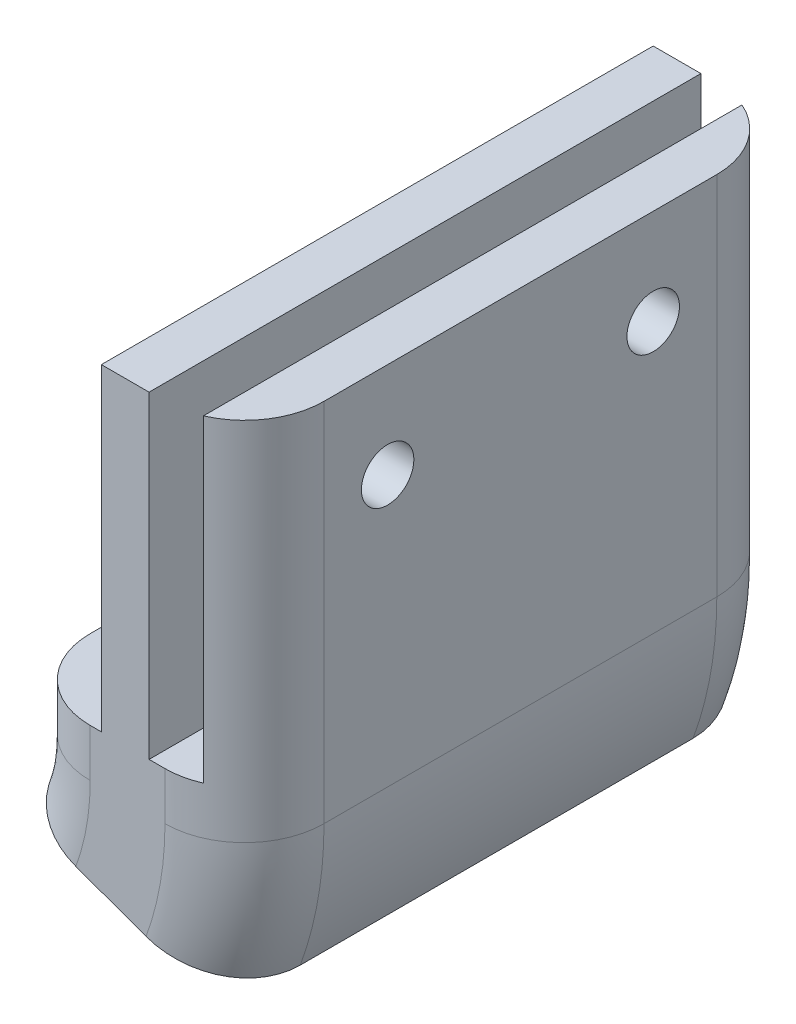
ISO-10303-21;
HEADER;
FILE_DESCRIPTION(('STEP AP214'),'2;1');
FILE_NAME('part.step','',(''),(''),'','','');
FILE_SCHEMA(('AUTOMOTIVE_DESIGN { 1 0 10303 214 1 1 1 1 }'));
ENDSEC;
DATA;
#1=APPLICATION_CONTEXT('core data for automotive mechanical design processes');
#2=APPLICATION_PROTOCOL_DEFINITION('international standard','automotive_design',2000,#1);
#3=PRODUCT_CONTEXT('',#1,'mechanical');
#4=PRODUCT('Part','Part','',(#3));
#5=PRODUCT_RELATED_PRODUCT_CATEGORY('part','',(#4));
#6=PRODUCT_DEFINITION_FORMATION('','',#4);
#7=PRODUCT_DEFINITION_CONTEXT('part definition',#1,'design');
#8=PRODUCT_DEFINITION('design','',#6,#7);
#9=PRODUCT_DEFINITION_SHAPE('','',#8);
#10=(LENGTH_UNIT() NAMED_UNIT(*) SI_UNIT(.MILLI.,.METRE.));
#11=(NAMED_UNIT(*) PLANE_ANGLE_UNIT() SI_UNIT($,.RADIAN.));
#12=(NAMED_UNIT(*) SI_UNIT($,.STERADIAN.) SOLID_ANGLE_UNIT());
#13=UNCERTAINTY_MEASURE_WITH_UNIT(LENGTH_MEASURE(1.E-05),#10,'distance_accuracy_value','');
#14=(GEOMETRIC_REPRESENTATION_CONTEXT(3) GLOBAL_UNCERTAINTY_ASSIGNED_CONTEXT((#13)) GLOBAL_UNIT_ASSIGNED_CONTEXT((#10,
#11,#12)) REPRESENTATION_CONTEXT('',''));
#15=CARTESIAN_POINT('',(0.,0.,0.));
#16=DIRECTION('',(0.,0.,1.));
#17=DIRECTION('',(1.,0.,0.));
#18=AXIS2_PLACEMENT_3D('',#15,#16,#17);
#19=CARTESIAN_POINT('',(2.35,3.,12.35));
#20=DIRECTION('',(0.,1.,0.));
#21=DIRECTION('',(0.,0.,1.));
#22=AXIS2_PLACEMENT_3D('',#19,#20,#21);
#23=PLANE('',#22);
#24=DIRECTION('',(-1.,0.,0.));
#25=VECTOR('',#24,1.);
#26=CARTESIAN_POINT('',(2.35,3.,-17.35));
#27=LINE('',#26,#25);
#28=CARTESIAN_POINT('',(2.35,3.,-17.35));
#29=VERTEX_POINT('',#28);
#30=CARTESIAN_POINT('',(1.35,3.,-17.35));
#31=VERTEX_POINT('',#30);
#32=EDGE_CURVE('E428',#29,#31,#27,.T.);
#33=ORIENTED_EDGE('',*,*,#32,.T.);
#34=DIRECTION('',(0.,0.,-1.));
#35=VECTOR('',#34,1.);
#36=CARTESIAN_POINT('',(1.35,3.,-17.35));
#37=LINE('',#36,#35);
#38=CARTESIAN_POINT('',(1.35,3.,17.35));
#39=VERTEX_POINT('',#38);
#40=EDGE_CURVE('E334',#39,#31,#37,.T.);
#41=ORIENTED_EDGE('',*,*,#40,.F.);
#42=DIRECTION('',(1.,0.,0.));
#43=VECTOR('',#42,1.);
#44=CARTESIAN_POINT('',(2.35,3.,17.35));
#45=LINE('',#44,#43);
#46=CARTESIAN_POINT('',(2.35,3.,17.35));
#47=VERTEX_POINT('',#46);
#48=EDGE_CURVE('E436',#39,#47,#45,.T.);
#49=ORIENTED_EDGE('',*,*,#48,.T.);
#50=CARTESIAN_POINT('',(2.35,3.,12.35));
#51=DIRECTION('',(0.,1.,0.));
#52=DIRECTION('',(0.,0.,1.));
#53=AXIS2_PLACEMENT_3D('',#50,#51,#52);
#54=CIRCLE('',#53,5.);
#55=CARTESIAN_POINT('',(4.35,3.,16.9325756949558));
#56=VERTEX_POINT('',#55);
#57=EDGE_CURVE('E422',#47,#56,#54,.T.);
#58=ORIENTED_EDGE('',*,*,#57,.T.);
#59=DIRECTION('',(0.,0.,1.));
#60=VECTOR('',#59,1.);
#61=CARTESIAN_POINT('',(4.35,3.,-16.9325756949558));
#62=LINE('',#61,#60);
#63=CARTESIAN_POINT('',(4.35,3.,-16.9325756949558));
#64=VERTEX_POINT('',#63);
#65=EDGE_CURVE('E361',#64,#56,#62,.T.);
#66=ORIENTED_EDGE('',*,*,#65,.F.);
#67=CARTESIAN_POINT('',(2.35,3.,-12.35));
#68=DIRECTION('',(0.,1.,0.));
#69=DIRECTION('',(0.,0.,1.));
#70=AXIS2_PLACEMENT_3D('',#67,#68,#69);
#71=CIRCLE('',#70,5.);
#72=EDGE_CURVE('E424',#64,#29,#71,.T.);
#73=ORIENTED_EDGE('',*,*,#72,.T.);
#74=EDGE_LOOP('',(#33,#41,#49,#58,#66,#73));
#75=FACE_BOUND('',#74,.T.);
#76=ADVANCED_FACE('F34',(#75),#23,.T.);
#77=CARTESIAN_POINT('',(-2.35,3.,17.35));
#78=VERTEX_POINT('',#77);
#79=CARTESIAN_POINT('',(-1.64999999999999,3.,17.35));
#80=VERTEX_POINT('',#79);
#81=EDGE_CURVE('E437',#78,#80,#45,.T.);
#82=ORIENTED_EDGE('',*,*,#81,.T.);
#83=DIRECTION('',(0.,0.,1.));
#84=VECTOR('',#83,1.);
#85=CARTESIAN_POINT('',(-1.65,3.,-17.35));
#86=LINE('',#85,#84);
#87=CARTESIAN_POINT('',(-1.65,3.,-17.35));
#88=VERTEX_POINT('',#87);
#89=EDGE_CURVE('E339',#88,#80,#86,.T.);
#90=ORIENTED_EDGE('',*,*,#89,.F.);
#91=CARTESIAN_POINT('',(-2.35,3.,-17.35));
#92=VERTEX_POINT('',#91);
#93=EDGE_CURVE('E427',#88,#92,#27,.T.);
#94=ORIENTED_EDGE('',*,*,#93,.T.);
#95=CARTESIAN_POINT('',(-2.35,3.,-12.35));
#96=DIRECTION('',(0.,1.,0.));
#97=DIRECTION('',(0.,0.,1.));
#98=AXIS2_PLACEMENT_3D('',#95,#96,#97);
#99=CIRCLE('',#98,5.);
#100=CARTESIAN_POINT('',(-7.35,3.,-12.35));
#101=VERTEX_POINT('',#100);
#102=EDGE_CURVE('E430',#92,#101,#99,.T.);
#103=ORIENTED_EDGE('',*,*,#102,.T.);
#104=DIRECTION('',(0.,0.,1.));
#105=VECTOR('',#104,1.);
#106=CARTESIAN_POINT('',(-7.35,3.,12.35));
#107=LINE('',#106,#105);
#108=CARTESIAN_POINT('',(-7.35,3.,12.35));
#109=VERTEX_POINT('',#108);
#110=EDGE_CURVE('E432',#101,#109,#107,.T.);
#111=ORIENTED_EDGE('',*,*,#110,.T.);
#112=CARTESIAN_POINT('',(-2.35,3.,12.35));
#113=DIRECTION('',(0.,1.,0.));
#114=DIRECTION('',(0.,0.,-1.));
#115=AXIS2_PLACEMENT_3D('',#112,#113,#114);
#116=CIRCLE('',#115,5.);
#117=EDGE_CURVE('E434',#109,#78,#116,.T.);
#118=ORIENTED_EDGE('',*,*,#117,.T.);
#119=EDGE_LOOP('',(#82,#90,#94,#103,#111,#118));
#120=FACE_BOUND('',#119,.T.);
#121=ADVANCED_FACE('F547',(#120),#23,.T.);
#122=CARTESIAN_POINT('',(2.35,3.,12.35));
#123=DIRECTION('',(0.,-1.,0.));
#124=DIRECTION('',(0.,0.,-1.));
#125=AXIS2_PLACEMENT_3D('',#122,#123,#124);
#126=CYLINDRICAL_SURFACE('',#125,5.);
#127=CARTESIAN_POINT('',(2.35,0.,12.35));
#128=DIRECTION('',(0.,1.,0.));
#129=DIRECTION('',(0.,0.,1.));
#130=AXIS2_PLACEMENT_3D('',#127,#128,#129);
#131=CIRCLE('',#130,5.);
#132=CARTESIAN_POINT('',(2.35,0.,17.35));
#133=VERTEX_POINT('',#132);
#134=CARTESIAN_POINT('',(7.35,0.,12.35));
#135=VERTEX_POINT('',#134);
#136=EDGE_CURVE('E421',#133,#135,#131,.T.);
#137=ORIENTED_EDGE('',*,*,#136,.T.);
#138=DIRECTION('',(0.,-1.,0.));
#139=VECTOR('',#138,1.);
#140=CARTESIAN_POINT('',(7.35,3.,12.35));
#141=LINE('',#140,#139);
#142=CARTESIAN_POINT('',(7.35,23.,12.35));
#143=VERTEX_POINT('',#142);
#144=EDGE_CURVE('E11',#143,#135,#141,.T.);
#145=ORIENTED_EDGE('',*,*,#144,.F.);
#146=CARTESIAN_POINT('',(2.35,23.,12.35));
#147=DIRECTION('',(0.,1.,0.));
#148=DIRECTION('',(0.,0.,1.));
#149=AXIS2_PLACEMENT_3D('',#146,#147,#148);
#150=CIRCLE('',#149,5.);
#151=CARTESIAN_POINT('',(4.35,23.,16.9325756949558));
#152=VERTEX_POINT('',#151);
#153=EDGE_CURVE('E362',#152,#143,#150,.T.);
#154=ORIENTED_EDGE('',*,*,#153,.F.);
#155=DIRECTION('',(0.,-1.,0.));
#156=VECTOR('',#155,1.);
#157=CARTESIAN_POINT('',(4.35,23.,16.9325756949558));
#158=LINE('',#157,#156);
#159=EDGE_CURVE('E372',#152,#56,#158,.T.);
#160=ORIENTED_EDGE('',*,*,#159,.T.);
#161=ORIENTED_EDGE('',*,*,#57,.F.);
#162=DIRECTION('',(0.,-1.,0.));
#163=VECTOR('',#162,1.);
#164=CARTESIAN_POINT('',(2.35,3.,17.35));
#165=LINE('',#164,#163);
#166=EDGE_CURVE('E439',#47,#133,#165,.T.);
#167=ORIENTED_EDGE('',*,*,#166,.T.);
#168=EDGE_LOOP('',(#137,#145,#154,#160,#161,#167));
#169=FACE_BOUND('',#168,.T.);
#170=ADVANCED_FACE('F36',(#169),#126,.T.);
#171=CARTESIAN_POINT('',(7.35,3.,12.35));
#172=DIRECTION('',(-1.,0.,0.));
#173=DIRECTION('',(0.,0.,1.));
#174=AXIS2_PLACEMENT_3D('',#171,#172,#173);
#175=PLANE('',#174);
#176=CARTESIAN_POINT('',(7.35,17.,8.35));
#177=DIRECTION('',(1.,0.,0.));
#178=DIRECTION('',(0.,0.,-1.));
#179=AXIS2_PLACEMENT_3D('',#176,#177,#178);
#180=CIRCLE('',#179,1.65);
#181=CARTESIAN_POINT('',(7.35,17.,6.7));
#182=VERTEX_POINT('',#181);
#183=EDGE_CURVE('E323',#182,#182,#180,.T.);
#184=ORIENTED_EDGE('',*,*,#183,.F.);
#185=EDGE_LOOP('',(#184));
#186=FACE_BOUND('',#185,.T.);
#187=CARTESIAN_POINT('',(7.35,17.,-8.35));
#188=DIRECTION('',(1.,0.,0.));
#189=DIRECTION('',(0.,0.,1.));
#190=AXIS2_PLACEMENT_3D('',#187,#188,#189);
#191=CIRCLE('',#190,1.65);
#192=CARTESIAN_POINT('',(7.35,17.,-6.7));
#193=VERTEX_POINT('',#192);
#194=EDGE_CURVE('E275',#193,#193,#191,.T.);
#195=ORIENTED_EDGE('',*,*,#194,.F.);
#196=EDGE_LOOP('',(#195));
#197=FACE_BOUND('',#196,.T.);
#198=DIRECTION('',(0.,0.,-1.));
#199=VECTOR('',#198,1.);
#200=CARTESIAN_POINT('',(7.35,0.,12.35));
#201=LINE('',#200,#199);
#202=CARTESIAN_POINT('',(7.35,0.,-12.35));
#203=VERTEX_POINT('',#202);
#204=EDGE_CURVE('E442',#135,#203,#201,.T.);
#205=ORIENTED_EDGE('',*,*,#204,.T.);
#206=DIRECTION('',(0.,-1.,0.));
#207=VECTOR('',#206,1.);
#208=CARTESIAN_POINT('',(7.35,3.,-12.35));
#209=LINE('',#208,#207);
#210=CARTESIAN_POINT('',(7.35,23.,-12.35));
#211=VERTEX_POINT('',#210);
#212=EDGE_CURVE('E42',#211,#203,#209,.T.);
#213=ORIENTED_EDGE('',*,*,#212,.F.);
#214=DIRECTION('',(0.,0.,-1.));
#215=VECTOR('',#214,1.);
#216=CARTESIAN_POINT('',(7.35,23.,12.35));
#217=LINE('',#216,#215);
#218=EDGE_CURVE('E365',#143,#211,#217,.T.);
#219=ORIENTED_EDGE('',*,*,#218,.F.);
#220=ORIENTED_EDGE('',*,*,#144,.T.);
#221=EDGE_LOOP('',(#205,#213,#219,#220));
#222=FACE_BOUND('',#221,.T.);
#223=ADVANCED_FACE('F480',(#186,#197,#222),#175,.F.);
#224=CARTESIAN_POINT('',(2.35,3.,-12.35));
#225=DIRECTION('',(0.,-1.,0.));
#226=DIRECTION('',(0.,0.,-1.));
#227=AXIS2_PLACEMENT_3D('',#224,#225,#226);
#228=CYLINDRICAL_SURFACE('',#227,5.);
#229=CARTESIAN_POINT('',(2.35,0.,-12.35));
#230=DIRECTION('',(0.,1.,0.));
#231=DIRECTION('',(0.,0.,1.));
#232=AXIS2_PLACEMENT_3D('',#229,#230,#231);
#233=CIRCLE('',#232,5.);
#234=CARTESIAN_POINT('',(2.35,0.,-17.35));
#235=VERTEX_POINT('',#234);
#236=EDGE_CURVE('E445',#203,#235,#233,.T.);
#237=ORIENTED_EDGE('',*,*,#236,.T.);
#238=DIRECTION('',(0.,-1.,0.));
#239=VECTOR('',#238,1.);
#240=CARTESIAN_POINT('',(2.35,3.,-17.35));
#241=LINE('',#240,#239);
#242=EDGE_CURVE('E470',#29,#235,#241,.T.);
#243=ORIENTED_EDGE('',*,*,#242,.F.);
#244=ORIENTED_EDGE('',*,*,#72,.F.);
#245=DIRECTION('',(0.,-1.,0.));
#246=VECTOR('',#245,1.);
#247=CARTESIAN_POINT('',(4.35,23.,-16.9325756949558));
#248=LINE('',#247,#246);
#249=CARTESIAN_POINT('',(4.35,23.,-16.9325756949558));
#250=VERTEX_POINT('',#249);
#251=EDGE_CURVE('E377',#250,#64,#248,.T.);
#252=ORIENTED_EDGE('',*,*,#251,.F.);
#253=CARTESIAN_POINT('',(2.35,23.,-12.35));
#254=DIRECTION('',(0.,1.,0.));
#255=DIRECTION('',(0.,0.,1.));
#256=AXIS2_PLACEMENT_3D('',#253,#254,#255);
#257=CIRCLE('',#256,5.);
#258=EDGE_CURVE('E368',#211,#250,#257,.T.);
#259=ORIENTED_EDGE('',*,*,#258,.F.);
#260=ORIENTED_EDGE('',*,*,#212,.T.);
#261=EDGE_LOOP('',(#237,#243,#244,#252,#259,#260));
#262=FACE_BOUND('',#261,.T.);
#263=ADVANCED_FACE('F475',(#262),#228,.T.);
#264=CARTESIAN_POINT('',(2.35,3.,-17.35));
#265=DIRECTION('',(0.,0.,1.));
#266=DIRECTION('',(1.,0.,0.));
#267=AXIS2_PLACEMENT_3D('',#264,#265,#266);
#268=PLANE('',#267);
#269=ORIENTED_EDGE('',*,*,#242,.T.);
#270=CARTESIAN_POINT('',(-17.35,0.,-17.35));
#271=DIRECTION('',(0.,0.,1.));
#272=DIRECTION('',(1.,0.,0.));
#273=AXIS2_PLACEMENT_3D('',#270,#271,#272);
#274=CIRCLE('',#273,19.7);
#275=CARTESIAN_POINT('',(1.16194462948239,-6.73779682351569,-17.35));
#276=VERTEX_POINT('',#275);
#277=EDGE_CURVE('E404',#276,#235,#274,.T.);
#278=ORIENTED_EDGE('',*,*,#277,.F.);
#279=DIRECTION('',(0.939692620785908,-0.342020143325669,0.));
#280=VECTOR('',#279,1.);
#281=CARTESIAN_POINT('',(1.16194462948239,-6.73779682351569,-17.35));
#282=LINE('',#281,#280);
#283=CARTESIAN_POINT('',(-3.25461068821138,-5.13030214988504,-17.35));
#284=VERTEX_POINT('',#283);
#285=EDGE_CURVE('E401',#284,#276,#282,.T.);
#286=ORIENTED_EDGE('',*,*,#285,.F.);
#287=CARTESIAN_POINT('',(-17.35,0.,-17.35));
#288=DIRECTION('',(0.,0.,1.));
#289=DIRECTION('',(1.,0.,0.));
#290=AXIS2_PLACEMENT_3D('',#287,#288,#289);
#291=CIRCLE('',#290,15.);
#292=CARTESIAN_POINT('',(-2.35,0.,-17.35));
#293=VERTEX_POINT('',#292);
#294=EDGE_CURVE('E406',#284,#293,#291,.T.);
#295=ORIENTED_EDGE('',*,*,#294,.T.);
#296=DIRECTION('',(0.,-1.,0.));
#297=VECTOR('',#296,1.);
#298=CARTESIAN_POINT('',(-2.35,3.,-17.35));
#299=LINE('',#298,#297);
#300=EDGE_CURVE('E467',#92,#293,#299,.T.);
#301=ORIENTED_EDGE('',*,*,#300,.F.);
#302=ORIENTED_EDGE('',*,*,#93,.F.);
#303=DIRECTION('',(0.,-1.,0.));
#304=VECTOR('',#303,1.);
#305=CARTESIAN_POINT('',(-1.65,23.,-17.35));
#306=LINE('',#305,#304);
#307=CARTESIAN_POINT('',(-1.65,23.,-17.35));
#308=VERTEX_POINT('',#307);
#309=EDGE_CURVE('E355',#308,#88,#306,.T.);
#310=ORIENTED_EDGE('',*,*,#309,.F.);
#311=DIRECTION('',(-1.,0.,0.));
#312=VECTOR('',#311,1.);
#313=CARTESIAN_POINT('',(1.35,23.,-17.35));
#314=LINE('',#313,#312);
#315=CARTESIAN_POINT('',(1.35,23.,-17.35));
#316=VERTEX_POINT('',#315);
#317=EDGE_CURVE('E338',#316,#308,#314,.T.);
#318=ORIENTED_EDGE('',*,*,#317,.F.);
#319=DIRECTION('',(0.,-1.,0.));
#320=VECTOR('',#319,1.);
#321=CARTESIAN_POINT('',(1.35,23.,-17.35));
#322=LINE('',#321,#320);
#323=EDGE_CURVE('E358',#316,#31,#322,.T.);
#324=ORIENTED_EDGE('',*,*,#323,.T.);
#325=ORIENTED_EDGE('',*,*,#32,.F.);
#326=EDGE_LOOP('',(#269,#278,#286,#295,#301,#302,#310,#318,#324,#325));
#327=FACE_BOUND('',#326,.T.);
#328=ADVANCED_FACE('F505',(#327),#268,.F.);
#329=CARTESIAN_POINT('',(-2.35,3.,-12.35));
#330=DIRECTION('',(0.,-1.,0.));
#331=DIRECTION('',(0.,0.,-1.));
#332=AXIS2_PLACEMENT_3D('',#329,#330,#331);
#333=CYLINDRICAL_SURFACE('',#332,5.);
#334=CARTESIAN_POINT('',(-2.35,0.,-12.35));
#335=DIRECTION('',(0.,1.,0.));
#336=DIRECTION('',(0.,0.,1.));
#337=AXIS2_PLACEMENT_3D('',#334,#335,#336);
#338=CIRCLE('',#337,5.);
#339=CARTESIAN_POINT('',(-7.35,0.,-12.35));
#340=VERTEX_POINT('',#339);
#341=EDGE_CURVE('E448',#293,#340,#338,.T.);
#342=ORIENTED_EDGE('',*,*,#341,.T.);
#343=DIRECTION('',(0.,-1.,0.));
#344=VECTOR('',#343,1.);
#345=CARTESIAN_POINT('',(-7.35,3.,-12.35));
#346=LINE('',#345,#344);
#347=EDGE_CURVE('E464',#101,#340,#346,.T.);
#348=ORIENTED_EDGE('',*,*,#347,.F.);
#349=ORIENTED_EDGE('',*,*,#102,.F.);
#350=ORIENTED_EDGE('',*,*,#300,.T.);
#351=EDGE_LOOP('',(#342,#348,#349,#350));
#352=FACE_BOUND('',#351,.T.);
#353=ADVANCED_FACE('F531',(#352),#333,.T.);
#354=CARTESIAN_POINT('',(-7.35,3.,12.35));
#355=DIRECTION('',(1.,0.,0.));
#356=DIRECTION('',(0.,0.,-1.));
#357=AXIS2_PLACEMENT_3D('',#354,#355,#356);
#358=PLANE('',#357);
#359=DIRECTION('',(0.,0.,1.));
#360=VECTOR('',#359,1.);
#361=CARTESIAN_POINT('',(-7.35,0.,12.35));
#362=LINE('',#361,#360);
#363=CARTESIAN_POINT('',(-7.35,0.,12.35));
#364=VERTEX_POINT('',#363);
#365=EDGE_CURVE('E451',#340,#364,#362,.T.);
#366=ORIENTED_EDGE('',*,*,#365,.T.);
#367=DIRECTION('',(0.,-1.,0.));
#368=VECTOR('',#367,1.);
#369=CARTESIAN_POINT('',(-7.35,3.,12.35));
#370=LINE('',#369,#368);
#371=EDGE_CURVE('E461',#109,#364,#370,.T.);
#372=ORIENTED_EDGE('',*,*,#371,.F.);
#373=ORIENTED_EDGE('',*,*,#110,.F.);
#374=ORIENTED_EDGE('',*,*,#347,.T.);
#375=EDGE_LOOP('',(#366,#372,#373,#374));
#376=FACE_BOUND('',#375,.T.);
#377=ADVANCED_FACE('F554',(#376),#358,.F.);
#378=CARTESIAN_POINT('',(-2.35,3.,12.35));
#379=DIRECTION('',(0.,-1.,0.));
#380=DIRECTION('',(0.,0.,-1.));
#381=AXIS2_PLACEMENT_3D('',#378,#379,#380);
#382=CYLINDRICAL_SURFACE('',#381,5.);
#383=CARTESIAN_POINT('',(-2.35,0.,12.35));
#384=DIRECTION('',(0.,1.,0.));
#385=DIRECTION('',(0.,0.,-1.));
#386=AXIS2_PLACEMENT_3D('',#383,#384,#385);
#387=CIRCLE('',#386,5.);
#388=CARTESIAN_POINT('',(-2.35,0.,17.35));
#389=VERTEX_POINT('',#388);
#390=EDGE_CURVE('E425',#364,#389,#387,.T.);
#391=ORIENTED_EDGE('',*,*,#390,.T.);
#392=DIRECTION('',(0.,-1.,0.));
#393=VECTOR('',#392,1.);
#394=CARTESIAN_POINT('',(-2.35,3.,17.35));
#395=LINE('',#394,#393);
#396=EDGE_CURVE('E458',#78,#389,#395,.T.);
#397=ORIENTED_EDGE('',*,*,#396,.F.);
#398=ORIENTED_EDGE('',*,*,#117,.F.);
#399=ORIENTED_EDGE('',*,*,#371,.T.);
#400=EDGE_LOOP('',(#391,#397,#398,#399));
#401=FACE_BOUND('',#400,.T.);
#402=ADVANCED_FACE('F552',(#401),#382,.T.);
#403=CARTESIAN_POINT('',(2.35,3.,17.35));
#404=DIRECTION('',(0.,0.,-1.));
#405=DIRECTION('',(-1.,0.,0.));
#406=AXIS2_PLACEMENT_3D('',#403,#404,#405);
#407=PLANE('',#406);
#408=ORIENTED_EDGE('',*,*,#396,.T.);
#409=CARTESIAN_POINT('',(-17.35,0.,17.35));
#410=DIRECTION('',(0.,0.,1.));
#411=DIRECTION('',(1.,0.,0.));
#412=AXIS2_PLACEMENT_3D('',#409,#410,#411);
#413=CIRCLE('',#412,15.);
#414=CARTESIAN_POINT('',(-3.25461068821138,-5.13030214988504,17.35));
#415=VERTEX_POINT('',#414);
#416=EDGE_CURVE('E412',#415,#389,#413,.T.);
#417=ORIENTED_EDGE('',*,*,#416,.F.);
#418=DIRECTION('',(-0.939692620785908,0.342020143325669,0.));
#419=VECTOR('',#418,1.);
#420=CARTESIAN_POINT('',(1.16194462948239,-6.73779682351569,17.35));
#421=LINE('',#420,#419);
#422=CARTESIAN_POINT('',(1.16194462948239,-6.73779682351569,17.35));
#423=VERTEX_POINT('',#422);
#424=EDGE_CURVE('E389',#423,#415,#421,.T.);
#425=ORIENTED_EDGE('',*,*,#424,.F.);
#426=CARTESIAN_POINT('',(-17.35,0.,17.35));
#427=DIRECTION('',(0.,0.,1.));
#428=DIRECTION('',(1.,0.,0.));
#429=AXIS2_PLACEMENT_3D('',#426,#427,#428);
#430=CIRCLE('',#429,19.7);
#431=EDGE_CURVE('E414',#423,#133,#430,.T.);
#432=ORIENTED_EDGE('',*,*,#431,.T.);
#433=ORIENTED_EDGE('',*,*,#166,.F.);
#434=ORIENTED_EDGE('',*,*,#48,.F.);
#435=DIRECTION('',(0.,-1.,0.));
#436=VECTOR('',#435,1.);
#437=CARTESIAN_POINT('',(1.35,23.,17.35));
#438=LINE('',#437,#436);
#439=CARTESIAN_POINT('',(1.35,23.,17.35));
#440=VERTEX_POINT('',#439);
#441=EDGE_CURVE('E345',#440,#39,#438,.T.);
#442=ORIENTED_EDGE('',*,*,#441,.F.);
#443=DIRECTION('',(1.,0.,0.));
#444=VECTOR('',#443,1.);
#445=CARTESIAN_POINT('',(1.35,23.,17.35));
#446=LINE('',#445,#444);
#447=CARTESIAN_POINT('',(-1.65,23.,17.35));
#448=VERTEX_POINT('',#447);
#449=EDGE_CURVE('E343',#448,#440,#446,.T.);
#450=ORIENTED_EDGE('',*,*,#449,.F.);
#451=DIRECTION('',(0.,-1.,0.));
#452=VECTOR('',#451,1.);
#453=CARTESIAN_POINT('',(-1.65,23.,17.35));
#454=LINE('',#453,#452);
#455=EDGE_CURVE('E352',#448,#80,#454,.T.);
#456=ORIENTED_EDGE('',*,*,#455,.T.);
#457=ORIENTED_EDGE('',*,*,#81,.F.);
#458=EDGE_LOOP('',(#408,#417,#425,#432,#433,#434,#442,#450,#456,#457));
#459=FACE_BOUND('',#458,.T.);
#460=ADVANCED_FACE('F516',(#459),#407,.F.);
#461=CARTESIAN_POINT('',(-17.35,0.,-12.35));
#462=DIRECTION('',(0.,0.,1.));
#463=DIRECTION('',(1.,0.,0.));
#464=AXIS2_PLACEMENT_3D('',#461,#462,#463);
#465=TOROIDAL_SURFACE('',#464,19.7,5.);
#466=CARTESIAN_POINT('',(-17.35,0.,-12.35));
#467=DIRECTION('',(0.,0.,1.));
#468=DIRECTION('',(1.,0.,0.));
#469=AXIS2_PLACEMENT_3D('',#466,#467,#468);
#470=CIRCLE('',#469,24.7);
#471=CARTESIAN_POINT('',(5.86040773341193,-8.44789754014403,-12.35));
#472=VERTEX_POINT('',#471);
#473=EDGE_CURVE('E418',#472,#203,#470,.T.);
#474=ORIENTED_EDGE('',*,*,#473,.F.);
#475=CARTESIAN_POINT('',(1.16194462948239,-6.73779682351569,-12.35));
#476=DIRECTION('',(-0.342020143325669,-0.939692620785908,0.));
#477=DIRECTION('',(0.,0.,-1.));
#478=AXIS2_PLACEMENT_3D('',#475,#476,#477);
#479=CIRCLE('',#478,5.);
#480=EDGE_CURVE('E380',#276,#472,#479,.T.);
#481=ORIENTED_EDGE('',*,*,#480,.F.);
#482=ORIENTED_EDGE('',*,*,#277,.T.);
#483=ORIENTED_EDGE('',*,*,#236,.F.);
#484=EDGE_LOOP('',(#474,#481,#482,#483));
#485=FACE_BOUND('',#484,.T.);
#486=ADVANCED_FACE('F499',(#485),#465,.T.);
#487=CARTESIAN_POINT('',(-17.35,0.,12.35));
#488=DIRECTION('',(0.,0.,1.));
#489=DIRECTION('',(1.,0.,0.));
#490=AXIS2_PLACEMENT_3D('',#487,#488,#489);
#491=CYLINDRICAL_SURFACE('',#490,24.7);
#492=CARTESIAN_POINT('',(-17.35,0.,12.35));
#493=DIRECTION('',(0.,0.,1.));
#494=DIRECTION('',(1.,0.,0.));
#495=AXIS2_PLACEMENT_3D('',#492,#493,#494);
#496=CIRCLE('',#495,24.7);
#497=CARTESIAN_POINT('',(5.86040773341193,-8.44789754014404,12.35));
#498=VERTEX_POINT('',#497);
#499=EDGE_CURVE('E416',#498,#135,#496,.T.);
#500=ORIENTED_EDGE('',*,*,#499,.F.);
#501=DIRECTION('',(0.,0.,1.));
#502=VECTOR('',#501,1.);
#503=CARTESIAN_POINT('',(5.86040773341193,-8.44789754014403,-12.35));
#504=LINE('',#503,#502);
#505=EDGE_CURVE('E383',#472,#498,#504,.T.);
#506=ORIENTED_EDGE('',*,*,#505,.F.);
#507=ORIENTED_EDGE('',*,*,#473,.T.);
#508=ORIENTED_EDGE('',*,*,#204,.F.);
#509=EDGE_LOOP('',(#500,#506,#507,#508));
#510=FACE_BOUND('',#509,.T.);
#511=ADVANCED_FACE('F496',(#510),#491,.T.);
#512=CARTESIAN_POINT('',(-17.35,0.,12.35));
#513=DIRECTION('',(0.,0.,1.));
#514=DIRECTION('',(1.,0.,0.));
#515=AXIS2_PLACEMENT_3D('',#512,#513,#514);
#516=TOROIDAL_SURFACE('',#515,19.7,5.);
#517=ORIENTED_EDGE('',*,*,#431,.F.);
#518=CARTESIAN_POINT('',(1.16194462948239,-6.73779682351569,12.35));
#519=DIRECTION('',(-0.342020143325669,-0.939692620785908,0.));
#520=DIRECTION('',(0.,0.,-1.));
#521=AXIS2_PLACEMENT_3D('',#518,#519,#520);
#522=CIRCLE('',#521,5.);
#523=EDGE_CURVE('E386',#498,#423,#522,.T.);
#524=ORIENTED_EDGE('',*,*,#523,.F.);
#525=ORIENTED_EDGE('',*,*,#499,.T.);
#526=ORIENTED_EDGE('',*,*,#136,.F.);
#527=EDGE_LOOP('',(#517,#524,#525,#526));
#528=FACE_BOUND('',#527,.T.);
#529=ADVANCED_FACE('F492',(#528),#516,.T.);
#530=CARTESIAN_POINT('',(-17.35,0.,12.35));
#531=DIRECTION('',(0.,0.,1.));
#532=DIRECTION('',(1.,0.,0.));
#533=AXIS2_PLACEMENT_3D('',#530,#531,#532);
#534=TOROIDAL_SURFACE('',#533,15.,5.);
#535=CARTESIAN_POINT('',(-17.35,0.,12.35));
#536=DIRECTION('',(0.,0.,1.));
#537=DIRECTION('',(1.,0.,0.));
#538=AXIS2_PLACEMENT_3D('',#535,#536,#537);
#539=CIRCLE('',#538,10.);
#540=CARTESIAN_POINT('',(-7.95307379214092,-3.42020143325669,12.35));
#541=VERTEX_POINT('',#540);
#542=EDGE_CURVE('E410',#541,#364,#539,.T.);
#543=ORIENTED_EDGE('',*,*,#542,.F.);
#544=CARTESIAN_POINT('',(-3.25461068821138,-5.13030214988504,12.35));
#545=DIRECTION('',(-0.342020143325669,-0.939692620785908,0.));
#546=DIRECTION('',(0.,0.,-1.));
#547=AXIS2_PLACEMENT_3D('',#544,#545,#546);
#548=CIRCLE('',#547,5.);
#549=EDGE_CURVE('E392',#415,#541,#548,.T.);
#550=ORIENTED_EDGE('',*,*,#549,.F.);
#551=ORIENTED_EDGE('',*,*,#416,.T.);
#552=ORIENTED_EDGE('',*,*,#390,.F.);
#553=EDGE_LOOP('',(#543,#550,#551,#552));
#554=FACE_BOUND('',#553,.T.);
#555=ADVANCED_FACE('F521',(#554),#534,.T.);
#556=CARTESIAN_POINT('',(-17.35,0.,12.35));
#557=DIRECTION('',(0.,0.,1.));
#558=DIRECTION('',(1.,0.,0.));
#559=AXIS2_PLACEMENT_3D('',#556,#557,#558);
#560=CYLINDRICAL_SURFACE('',#559,10.);
#561=CARTESIAN_POINT('',(-17.35,0.,-12.35));
#562=DIRECTION('',(0.,0.,1.));
#563=DIRECTION('',(1.,0.,0.));
#564=AXIS2_PLACEMENT_3D('',#561,#562,#563);
#565=CIRCLE('',#564,9.99999999999999);
#566=CARTESIAN_POINT('',(-7.95307379214092,-3.42020143325669,-12.35));
#567=VERTEX_POINT('',#566);
#568=EDGE_CURVE('E408',#567,#340,#565,.T.);
#569=ORIENTED_EDGE('',*,*,#568,.F.);
#570=DIRECTION('',(0.,0.,-1.));
#571=VECTOR('',#570,1.);
#572=CARTESIAN_POINT('',(-7.95307379214092,-3.42020143325669,-12.35));
#573=LINE('',#572,#571);
#574=EDGE_CURVE('E395',#541,#567,#573,.T.);
#575=ORIENTED_EDGE('',*,*,#574,.F.);
#576=ORIENTED_EDGE('',*,*,#542,.T.);
#577=ORIENTED_EDGE('',*,*,#365,.F.);
#578=EDGE_LOOP('',(#569,#575,#576,#577));
#579=FACE_BOUND('',#578,.T.);
#580=ADVANCED_FACE('F525',(#579),#560,.F.);
#581=CARTESIAN_POINT('',(-17.35,0.,-12.35));
#582=DIRECTION('',(0.,0.,1.));
#583=DIRECTION('',(1.,0.,0.));
#584=AXIS2_PLACEMENT_3D('',#581,#582,#583);
#585=TOROIDAL_SURFACE('',#584,15.,5.);
#586=ORIENTED_EDGE('',*,*,#294,.F.);
#587=CARTESIAN_POINT('',(-3.25461068821138,-5.13030214988504,-12.35));
#588=DIRECTION('',(-0.342020143325669,-0.939692620785908,0.));
#589=DIRECTION('',(0.,0.,1.));
#590=AXIS2_PLACEMENT_3D('',#587,#588,#589);
#591=CIRCLE('',#590,5.);
#592=EDGE_CURVE('E398',#567,#284,#591,.T.);
#593=ORIENTED_EDGE('',*,*,#592,.F.);
#594=ORIENTED_EDGE('',*,*,#568,.T.);
#595=ORIENTED_EDGE('',*,*,#341,.F.);
#596=EDGE_LOOP('',(#586,#593,#594,#595));
#597=FACE_BOUND('',#596,.T.);
#598=ADVANCED_FACE('F527',(#597),#585,.T.);
#599=CARTESIAN_POINT('',(1.16194462948239,-6.73779682351569,-12.35));
#600=DIRECTION('',(-0.342020143325669,-0.939692620785908,0.));
#601=DIRECTION('',(0.,0.,-1.));
#602=AXIS2_PLACEMENT_3D('',#599,#600,#601);
#603=PLANE('',#602);
#604=ORIENTED_EDGE('',*,*,#480,.T.);
#605=ORIENTED_EDGE('',*,*,#505,.T.);
#606=ORIENTED_EDGE('',*,*,#523,.T.);
#607=ORIENTED_EDGE('',*,*,#424,.T.);
#608=ORIENTED_EDGE('',*,*,#549,.T.);
#609=ORIENTED_EDGE('',*,*,#574,.T.);
#610=ORIENTED_EDGE('',*,*,#592,.T.);
#611=ORIENTED_EDGE('',*,*,#285,.T.);
#612=EDGE_LOOP('',(#604,#605,#606,#607,#608,#609,#610,#611));
#613=FACE_BOUND('',#612,.T.);
#614=ADVANCED_FACE('F501',(#613),#603,.T.);
#615=CARTESIAN_POINT('',(4.35,23.,-16.9325756949558));
#616=DIRECTION('',(1.,0.,0.));
#617=DIRECTION('',(0.,0.,-1.));
#618=AXIS2_PLACEMENT_3D('',#615,#616,#617);
#619=PLANE('',#618);
#620=CARTESIAN_POINT('',(4.35,17.,8.35));
#621=DIRECTION('',(1.,0.,0.));
#622=DIRECTION('',(0.,0.,-1.));
#623=AXIS2_PLACEMENT_3D('',#620,#621,#622);
#624=CIRCLE('',#623,1.65);
#625=CARTESIAN_POINT('',(4.35,17.,6.7));
#626=VERTEX_POINT('',#625);
#627=EDGE_CURVE('E331',#626,#626,#624,.T.);
#628=ORIENTED_EDGE('',*,*,#627,.T.);
#629=EDGE_LOOP('',(#628));
#630=FACE_BOUND('',#629,.T.);
#631=CARTESIAN_POINT('',(4.35,17.,-8.35));
#632=DIRECTION('',(1.,0.,0.));
#633=DIRECTION('',(0.,0.,-1.));
#634=AXIS2_PLACEMENT_3D('',#631,#632,#633);
#635=CIRCLE('',#634,1.65);
#636=CARTESIAN_POINT('',(4.35,17.,-10.));
#637=VERTEX_POINT('',#636);
#638=EDGE_CURVE('E326',#637,#637,#635,.T.);
#639=ORIENTED_EDGE('',*,*,#638,.T.);
#640=EDGE_LOOP('',(#639));
#641=FACE_BOUND('',#640,.T.);
#642=ORIENTED_EDGE('',*,*,#65,.T.);
#643=ORIENTED_EDGE('',*,*,#159,.F.);
#644=DIRECTION('',(0.,0.,1.));
#645=VECTOR('',#644,1.);
#646=CARTESIAN_POINT('',(4.35,23.,-16.9325756949558));
#647=LINE('',#646,#645);
#648=EDGE_CURVE('E370',#250,#152,#647,.T.);
#649=ORIENTED_EDGE('',*,*,#648,.F.);
#650=ORIENTED_EDGE('',*,*,#251,.T.);
#651=EDGE_LOOP('',(#642,#643,#649,#650));
#652=FACE_BOUND('',#651,.T.);
#653=ADVANCED_FACE('F512',(#630,#641,#652),#619,.F.);
#654=CARTESIAN_POINT('',(2.35,23.,12.35));
#655=DIRECTION('',(0.,1.,0.));
#656=DIRECTION('',(0.,0.,1.));
#657=AXIS2_PLACEMENT_3D('',#654,#655,#656);
#658=PLANE('',#657);
#659=ORIENTED_EDGE('',*,*,#153,.T.);
#660=ORIENTED_EDGE('',*,*,#218,.T.);
#661=ORIENTED_EDGE('',*,*,#258,.T.);
#662=ORIENTED_EDGE('',*,*,#648,.T.);
#663=EDGE_LOOP('',(#659,#660,#661,#662));
#664=FACE_BOUND('',#663,.T.);
#665=ADVANCED_FACE('F483',(#664),#658,.T.);
#666=CARTESIAN_POINT('',(1.35,23.,-17.35));
#667=DIRECTION('',(-1.,0.,0.));
#668=DIRECTION('',(0.,0.,1.));
#669=AXIS2_PLACEMENT_3D('',#666,#667,#668);
#670=PLANE('',#669);
#671=DIRECTION('',(0.,-0.86602540378444,0.499999999999997));
#672=VECTOR('',#671,1.);
#673=CARTESIAN_POINT('',(1.35,17.,-5.05910346561912));
#674=LINE('',#673,#672);
#675=CARTESIAN_POINT('',(1.35,19.85,-6.70455173280954));
#676=VERTEX_POINT('',#675);
#677=CARTESIAN_POINT('',(1.35,17.,-5.05910346561912));
#678=VERTEX_POINT('',#677);
#679=EDGE_CURVE('E248',#676,#678,#674,.T.);
#680=ORIENTED_EDGE('',*,*,#679,.F.);
#681=DIRECTION('',(0.,0.,1.));
#682=VECTOR('',#681,1.);
#683=CARTESIAN_POINT('',(1.35,19.85,-6.70455173280954));
#684=LINE('',#683,#682);
#685=CARTESIAN_POINT('',(1.35,19.85,-9.99544826719042));
#686=VERTEX_POINT('',#685);
#687=EDGE_CURVE('E49',#686,#676,#684,.T.);
#688=ORIENTED_EDGE('',*,*,#687,.F.);
#689=DIRECTION('',(0.,0.866025403784434,0.500000000000009));
#690=VECTOR('',#689,1.);
#691=CARTESIAN_POINT('',(1.35,19.85,-9.99544826719042));
#692=LINE('',#691,#690);
#693=CARTESIAN_POINT('',(1.35,17.,-11.6408965343809));
#694=VERTEX_POINT('',#693);
#695=EDGE_CURVE('E322',#694,#686,#692,.T.);
#696=ORIENTED_EDGE('',*,*,#695,.F.);
#697=DIRECTION('',(0.,0.866025403784439,-0.499999999999999));
#698=VECTOR('',#697,1.);
#699=CARTESIAN_POINT('',(1.35,17.,-11.6408965343809));
#700=LINE('',#699,#698);
#701=CARTESIAN_POINT('',(1.35,14.15,-9.99544826719045));
#702=VERTEX_POINT('',#701);
#703=EDGE_CURVE('E906',#702,#694,#700,.T.);
#704=ORIENTED_EDGE('',*,*,#703,.F.);
#705=DIRECTION('',(0.,0.,-1.));
#706=VECTOR('',#705,1.);
#707=CARTESIAN_POINT('',(1.35,14.15,-9.99544826719045));
#708=LINE('',#707,#706);
#709=CARTESIAN_POINT('',(1.35,14.15,-6.70455173280958));
#710=VERTEX_POINT('',#709);
#711=EDGE_CURVE('E899',#710,#702,#708,.T.);
#712=ORIENTED_EDGE('',*,*,#711,.F.);
#713=DIRECTION('',(0.,-0.866025403784434,-0.500000000000009));
#714=VECTOR('',#713,1.);
#715=CARTESIAN_POINT('',(1.35,14.15,-6.70455173280958));
#716=LINE('',#715,#714);
#717=EDGE_CURVE('E897',#678,#710,#716,.T.);
#718=ORIENTED_EDGE('',*,*,#717,.F.);
#719=EDGE_LOOP('',(#680,#688,#696,#704,#712,#718));
#720=FACE_BOUND('',#719,.T.);
#721=DIRECTION('',(0.,-0.86602540378444,0.499999999999998));
#722=VECTOR('',#721,1.);
#723=CARTESIAN_POINT('',(1.35,17.,11.6408965343809));
#724=LINE('',#723,#722);
#725=CARTESIAN_POINT('',(1.35,19.85,9.99544826719045));
#726=VERTEX_POINT('',#725);
#727=CARTESIAN_POINT('',(1.35,17.,11.6408965343809));
#728=VERTEX_POINT('',#727);
#729=EDGE_CURVE('E288',#726,#728,#724,.T.);
#730=ORIENTED_EDGE('',*,*,#729,.F.);
#731=DIRECTION('',(0.,0.,1.));
#732=VECTOR('',#731,1.);
#733=CARTESIAN_POINT('',(1.35,19.85,9.99544826719045));
#734=LINE('',#733,#732);
#735=CARTESIAN_POINT('',(1.35,19.85,6.70455173280958));
#736=VERTEX_POINT('',#735);
#737=EDGE_CURVE('E57',#736,#726,#734,.T.);
#738=ORIENTED_EDGE('',*,*,#737,.F.);
#739=DIRECTION('',(0.,0.866025403784434,0.500000000000008));
#740=VECTOR('',#739,1.);
#741=CARTESIAN_POINT('',(1.35,19.85,6.70455173280958));
#742=LINE('',#741,#740);
#743=CARTESIAN_POINT('',(1.35,17.,5.05910346561912));
#744=VERTEX_POINT('',#743);
#745=EDGE_CURVE('E276',#744,#736,#742,.T.);
#746=ORIENTED_EDGE('',*,*,#745,.F.);
#747=DIRECTION('',(0.,0.86602540378444,-0.499999999999998));
#748=VECTOR('',#747,1.);
#749=CARTESIAN_POINT('',(1.35,17.,5.05910346561912));
#750=LINE('',#749,#748);
#751=CARTESIAN_POINT('',(1.35,14.15,6.70455173280954));
#752=VERTEX_POINT('',#751);
#753=EDGE_CURVE('E279',#752,#744,#750,.T.);
#754=ORIENTED_EDGE('',*,*,#753,.F.);
#755=DIRECTION('',(0.,0.,-1.));
#756=VECTOR('',#755,1.);
#757=CARTESIAN_POINT('',(1.35,14.15,6.70455173280954));
#758=LINE('',#757,#756);
#759=CARTESIAN_POINT('',(1.35,14.15,9.99544826719042));
#760=VERTEX_POINT('',#759);
#761=EDGE_CURVE('E282',#760,#752,#758,.T.);
#762=ORIENTED_EDGE('',*,*,#761,.F.);
#763=DIRECTION('',(0.,-0.866025403784434,-0.500000000000009));
#764=VECTOR('',#763,1.);
#765=CARTESIAN_POINT('',(1.35,14.15,9.99544826719042));
#766=LINE('',#765,#764);
#767=EDGE_CURVE('E285',#728,#760,#766,.T.);
#768=ORIENTED_EDGE('',*,*,#767,.F.);
#769=EDGE_LOOP('',(#730,#738,#746,#754,#762,#768));
#770=FACE_BOUND('',#769,.T.);
#771=ORIENTED_EDGE('',*,*,#40,.T.);
#772=ORIENTED_EDGE('',*,*,#323,.F.);
#773=DIRECTION('',(0.,0.,-1.));
#774=VECTOR('',#773,1.);
#775=CARTESIAN_POINT('',(1.35,23.,-17.35));
#776=LINE('',#775,#774);
#777=EDGE_CURVE('E335',#440,#316,#776,.T.);
#778=ORIENTED_EDGE('',*,*,#777,.F.);
#779=ORIENTED_EDGE('',*,*,#441,.T.);
#780=EDGE_LOOP('',(#771,#772,#778,#779));
#781=FACE_BOUND('',#780,.T.);
#782=ADVANCED_FACE('F544',(#720,#770,#781),#670,.F.);
#783=CARTESIAN_POINT('',(-1.65,23.,-17.35));
#784=DIRECTION('',(1.,0.,0.));
#785=DIRECTION('',(0.,0.,-1.));
#786=AXIS2_PLACEMENT_3D('',#783,#784,#785);
#787=PLANE('',#786);
#788=DIRECTION('',(0.,-0.866025403784433,-0.500000000000009));
#789=VECTOR('',#788,1.);
#790=CARTESIAN_POINT('',(-1.65,19.85,-9.99544826719042));
#791=LINE('',#790,#789);
#792=CARTESIAN_POINT('',(-1.65,19.85,-9.99544826719042));
#793=VERTEX_POINT('',#792);
#794=CARTESIAN_POINT('',(-1.65,17.,-11.6408965343809));
#795=VERTEX_POINT('',#794);
#796=EDGE_CURVE('E254',#793,#795,#791,.T.);
#797=ORIENTED_EDGE('',*,*,#796,.F.);
#798=DIRECTION('',(0.,0.,-1.));
#799=VECTOR('',#798,1.);
#800=CARTESIAN_POINT('',(-1.65,19.85,-6.70455173280954));
#801=LINE('',#800,#799);
#802=CARTESIAN_POINT('',(-1.65,19.85,-6.70455173280954));
#803=VERTEX_POINT('',#802);
#804=EDGE_CURVE('E233',#803,#793,#801,.T.);
#805=ORIENTED_EDGE('',*,*,#804,.F.);
#806=DIRECTION('',(0.,0.86602540378444,-0.499999999999997));
#807=VECTOR('',#806,1.);
#808=CARTESIAN_POINT('',(-1.65,17.,-5.05910346561912));
#809=LINE('',#808,#807);
#810=CARTESIAN_POINT('',(-1.65,17.,-5.05910346561911));
#811=VERTEX_POINT('',#810);
#812=EDGE_CURVE('E243',#811,#803,#809,.T.);
#813=ORIENTED_EDGE('',*,*,#812,.F.);
#814=DIRECTION('',(0.,0.866025403784433,0.500000000000009));
#815=VECTOR('',#814,1.);
#816=CARTESIAN_POINT('',(-1.65,14.15,-6.70455173280958));
#817=LINE('',#816,#815);
#818=CARTESIAN_POINT('',(-1.65,14.15,-6.70455173280958));
#819=VERTEX_POINT('',#818);
#820=EDGE_CURVE('E239',#819,#811,#817,.T.);
#821=ORIENTED_EDGE('',*,*,#820,.F.);
#822=DIRECTION('',(0.,0.,1.));
#823=VECTOR('',#822,1.);
#824=CARTESIAN_POINT('',(-1.65,14.15,-9.99544826719045));
#825=LINE('',#824,#823);
#826=CARTESIAN_POINT('',(-1.65,14.15,-9.99544826719045));
#827=VERTEX_POINT('',#826);
#828=EDGE_CURVE('E262',#827,#819,#825,.T.);
#829=ORIENTED_EDGE('',*,*,#828,.F.);
#830=DIRECTION('',(0.,-0.866025403784439,0.499999999999999));
#831=VECTOR('',#830,1.);
#832=CARTESIAN_POINT('',(-1.65,17.,-11.6408965343809));
#833=LINE('',#832,#831);
#834=EDGE_CURVE('E256',#795,#827,#833,.T.);
#835=ORIENTED_EDGE('',*,*,#834,.F.);
#836=EDGE_LOOP('',(#797,#805,#813,#821,#829,#835));
#837=FACE_BOUND('',#836,.T.);
#838=DIRECTION('',(0.,-0.866025403784434,-0.500000000000008));
#839=VECTOR('',#838,1.);
#840=CARTESIAN_POINT('',(-1.65,19.85,6.70455173280958));
#841=LINE('',#840,#839);
#842=CARTESIAN_POINT('',(-1.65,19.85,6.70455173280958));
#843=VERTEX_POINT('',#842);
#844=CARTESIAN_POINT('',(-1.65,17.,5.05910346561912));
#845=VERTEX_POINT('',#844);
#846=EDGE_CURVE('E297',#843,#845,#841,.T.);
#847=ORIENTED_EDGE('',*,*,#846,.F.);
#848=DIRECTION('',(0.,0.,-1.));
#849=VECTOR('',#848,1.);
#850=CARTESIAN_POINT('',(-1.65,19.85,9.99544826719045));
#851=LINE('',#850,#849);
#852=CARTESIAN_POINT('',(-1.65,19.85,9.99544826719045));
#853=VERTEX_POINT('',#852);
#854=EDGE_CURVE('E294',#853,#843,#851,.T.);
#855=ORIENTED_EDGE('',*,*,#854,.F.);
#856=DIRECTION('',(0.,0.86602540378444,-0.499999999999998));
#857=VECTOR('',#856,1.);
#858=CARTESIAN_POINT('',(-1.65,17.,11.6408965343809));
#859=LINE('',#858,#857);
#860=CARTESIAN_POINT('',(-1.65,17.,11.6408965343809));
#861=VERTEX_POINT('',#860);
#862=EDGE_CURVE('E291',#861,#853,#859,.T.);
#863=ORIENTED_EDGE('',*,*,#862,.F.);
#864=DIRECTION('',(0.,0.866025403784433,0.500000000000009));
#865=VECTOR('',#864,1.);
#866=CARTESIAN_POINT('',(-1.65,14.15,9.99544826719042));
#867=LINE('',#866,#865);
#868=CARTESIAN_POINT('',(-1.65,14.15,9.99544826719042));
#869=VERTEX_POINT('',#868);
#870=EDGE_CURVE('E306',#869,#861,#867,.T.);
#871=ORIENTED_EDGE('',*,*,#870,.F.);
#872=DIRECTION('',(0.,0.,1.));
#873=VECTOR('',#872,1.);
#874=CARTESIAN_POINT('',(-1.65,14.15,6.70455173280954));
#875=LINE('',#874,#873);
#876=CARTESIAN_POINT('',(-1.65,14.15,6.70455173280954));
#877=VERTEX_POINT('',#876);
#878=EDGE_CURVE('E303',#877,#869,#875,.T.);
#879=ORIENTED_EDGE('',*,*,#878,.F.);
#880=DIRECTION('',(0.,-0.86602540378444,0.499999999999998));
#881=VECTOR('',#880,1.);
#882=CARTESIAN_POINT('',(-1.65,17.,5.05910346561912));
#883=LINE('',#882,#881);
#884=EDGE_CURVE('E300',#845,#877,#883,.T.);
#885=ORIENTED_EDGE('',*,*,#884,.F.);
#886=EDGE_LOOP('',(#847,#855,#863,#871,#879,#885));
#887=FACE_BOUND('',#886,.T.);
#888=ORIENTED_EDGE('',*,*,#89,.T.);
#889=ORIENTED_EDGE('',*,*,#455,.F.);
#890=DIRECTION('',(0.,0.,1.));
#891=VECTOR('',#890,1.);
#892=CARTESIAN_POINT('',(-1.65,23.,-17.35));
#893=LINE('',#892,#891);
#894=EDGE_CURVE('E341',#308,#448,#893,.T.);
#895=ORIENTED_EDGE('',*,*,#894,.F.);
#896=ORIENTED_EDGE('',*,*,#309,.T.);
#897=EDGE_LOOP('',(#888,#889,#895,#896));
#898=FACE_BOUND('',#897,.T.);
#899=ADVANCED_FACE('F250',(#837,#887,#898),#787,.F.);
#900=CARTESIAN_POINT('',(0.,23.,0.));
#901=DIRECTION('',(0.,-1.,0.));
#902=DIRECTION('',(0.,0.,-1.));
#903=AXIS2_PLACEMENT_3D('',#900,#901,#902);
#904=PLANE('',#903);
#905=ORIENTED_EDGE('',*,*,#777,.T.);
#906=ORIENTED_EDGE('',*,*,#317,.T.);
#907=ORIENTED_EDGE('',*,*,#894,.T.);
#908=ORIENTED_EDGE('',*,*,#449,.T.);
#909=EDGE_LOOP('',(#905,#906,#907,#908));
#910=FACE_BOUND('',#909,.T.);
#911=ADVANCED_FACE('F540',(#910),#904,.F.);
#912=CARTESIAN_POINT('',(-7.95307379214092,17.,-8.35));
#913=DIRECTION('',(1.,0.,0.));
#914=DIRECTION('',(0.,0.,-1.));
#915=AXIS2_PLACEMENT_3D('',#912,#913,#914);
#916=CYLINDRICAL_SURFACE('',#915,1.65);
#917=ORIENTED_EDGE('',*,*,#194,.T.);
#918=EDGE_LOOP('',(#917));
#919=FACE_BOUND('',#918,.T.);
#920=ORIENTED_EDGE('',*,*,#638,.F.);
#921=EDGE_LOOP('',(#920));
#922=FACE_BOUND('',#921,.T.);
#923=ADVANCED_FACE('F644',(#919,#922),#916,.F.);
#924=CARTESIAN_POINT('',(-7.95307379214092,17.,8.35));
#925=DIRECTION('',(1.,0.,0.));
#926=DIRECTION('',(0.,0.,-1.));
#927=AXIS2_PLACEMENT_3D('',#924,#925,#926);
#928=CYLINDRICAL_SURFACE('',#927,1.65);
#929=ORIENTED_EDGE('',*,*,#183,.T.);
#930=EDGE_LOOP('',(#929));
#931=FACE_BOUND('',#930,.T.);
#932=ORIENTED_EDGE('',*,*,#627,.F.);
#933=EDGE_LOOP('',(#932));
#934=FACE_BOUND('',#933,.T.);
#935=ADVANCED_FACE('F650',(#931,#934),#928,.F.);
#936=CARTESIAN_POINT('',(7.35100000000001,19.85,9.99544826719045));
#937=DIRECTION('',(0.,1.,0.));
#938=DIRECTION('',(0.,0.,1.));
#939=AXIS2_PLACEMENT_3D('',#936,#937,#938);
#940=PLANE('',#939);
#941=ORIENTED_EDGE('',*,*,#737,.T.);
#942=DIRECTION('',(-1.,0.,0.));
#943=VECTOR('',#942,1.);
#944=CARTESIAN_POINT('',(7.35100000000001,19.85,9.99544826719045));
#945=LINE('',#944,#943);
#946=EDGE_CURVE('E308',#726,#853,#945,.T.);
#947=ORIENTED_EDGE('',*,*,#946,.T.);
#948=ORIENTED_EDGE('',*,*,#854,.T.);
#949=DIRECTION('',(-1.,0.,0.));
#950=VECTOR('',#949,1.);
#951=CARTESIAN_POINT('',(7.35100000000001,19.85,6.70455173280958));
#952=LINE('',#951,#950);
#953=EDGE_CURVE('E318',#736,#843,#952,.T.);
#954=ORIENTED_EDGE('',*,*,#953,.F.);
#955=EDGE_LOOP('',(#941,#947,#948,#954));
#956=FACE_BOUND('',#955,.T.);
#957=ADVANCED_FACE('F657',(#956),#940,.F.);
#958=CARTESIAN_POINT('',(7.35100000000001,19.85,6.70455173280958));
#959=DIRECTION('',(0.,0.500000000000008,-0.866025403784434));
#960=DIRECTION('',(0.,0.866025403784434,0.500000000000008));
#961=AXIS2_PLACEMENT_3D('',#958,#959,#960);
#962=PLANE('',#961);
#963=ORIENTED_EDGE('',*,*,#745,.T.);
#964=ORIENTED_EDGE('',*,*,#953,.T.);
#965=ORIENTED_EDGE('',*,*,#846,.T.);
#966=DIRECTION('',(-1.,0.,0.));
#967=VECTOR('',#966,1.);
#968=CARTESIAN_POINT('',(7.35100000000001,17.,5.05910346561911));
#969=LINE('',#968,#967);
#970=EDGE_CURVE('E316',#744,#845,#969,.T.);
#971=ORIENTED_EDGE('',*,*,#970,.F.);
#972=EDGE_LOOP('',(#963,#964,#965,#971));
#973=FACE_BOUND('',#972,.T.);
#974=ADVANCED_FACE('F664',(#973),#962,.F.);
#975=CARTESIAN_POINT('',(7.35100000000001,17.,5.05910346561911));
#976=DIRECTION('',(0.,-0.499999999999998,-0.86602540378444));
#977=DIRECTION('',(0.,0.86602540378444,-0.499999999999998));
#978=AXIS2_PLACEMENT_3D('',#975,#976,#977);
#979=PLANE('',#978);
#980=ORIENTED_EDGE('',*,*,#753,.T.);
#981=ORIENTED_EDGE('',*,*,#970,.T.);
#982=ORIENTED_EDGE('',*,*,#884,.T.);
#983=DIRECTION('',(-1.,0.,0.));
#984=VECTOR('',#983,1.);
#985=CARTESIAN_POINT('',(7.35100000000001,14.15,6.70455173280954));
#986=LINE('',#985,#984);
#987=EDGE_CURVE('E314',#752,#877,#986,.T.);
#988=ORIENTED_EDGE('',*,*,#987,.F.);
#989=EDGE_LOOP('',(#980,#981,#982,#988));
#990=FACE_BOUND('',#989,.T.);
#991=ADVANCED_FACE('F671',(#990),#979,.F.);
#992=CARTESIAN_POINT('',(7.35100000000001,14.15,6.70455173280954));
#993=DIRECTION('',(0.,-1.,0.));
#994=DIRECTION('',(0.,0.,-1.));
#995=AXIS2_PLACEMENT_3D('',#992,#993,#994);
#996=PLANE('',#995);
#997=ORIENTED_EDGE('',*,*,#761,.T.);
#998=ORIENTED_EDGE('',*,*,#987,.T.);
#999=ORIENTED_EDGE('',*,*,#878,.T.);
#1000=DIRECTION('',(-1.,0.,0.));
#1001=VECTOR('',#1000,1.);
#1002=CARTESIAN_POINT('',(7.35100000000001,14.15,9.99544826719042));
#1003=LINE('',#1002,#1001);
#1004=EDGE_CURVE('E312',#760,#869,#1003,.T.);
#1005=ORIENTED_EDGE('',*,*,#1004,.F.);
#1006=EDGE_LOOP('',(#997,#998,#999,#1005));
#1007=FACE_BOUND('',#1006,.T.);
#1008=ADVANCED_FACE('F679',(#1007),#996,.F.);
#1009=CARTESIAN_POINT('',(7.35100000000001,14.15,9.99544826719042));
#1010=DIRECTION('',(0.,-0.500000000000009,0.866025403784433));
#1011=DIRECTION('',(0.,-0.866025403784434,-0.500000000000009));
#1012=AXIS2_PLACEMENT_3D('',#1009,#1010,#1011);
#1013=PLANE('',#1012);
#1014=ORIENTED_EDGE('',*,*,#767,.T.);
#1015=ORIENTED_EDGE('',*,*,#1004,.T.);
#1016=ORIENTED_EDGE('',*,*,#870,.T.);
#1017=DIRECTION('',(-1.,0.,0.));
#1018=VECTOR('',#1017,1.);
#1019=CARTESIAN_POINT('',(7.35100000000001,17.,11.6408965343809));
#1020=LINE('',#1019,#1018);
#1021=EDGE_CURVE('E309',#728,#861,#1020,.T.);
#1022=ORIENTED_EDGE('',*,*,#1021,.F.);
#1023=EDGE_LOOP('',(#1014,#1015,#1016,#1022));
#1024=FACE_BOUND('',#1023,.T.);
#1025=ADVANCED_FACE('F687',(#1024),#1013,.F.);
#1026=CARTESIAN_POINT('',(7.35100000000001,17.,11.6408965343809));
#1027=DIRECTION('',(0.,0.499999999999998,0.86602540378444));
#1028=DIRECTION('',(0.,-0.86602540378444,0.499999999999998));
#1029=AXIS2_PLACEMENT_3D('',#1026,#1027,#1028);
#1030=PLANE('',#1029);
#1031=ORIENTED_EDGE('',*,*,#729,.T.);
#1032=ORIENTED_EDGE('',*,*,#1021,.T.);
#1033=ORIENTED_EDGE('',*,*,#862,.T.);
#1034=ORIENTED_EDGE('',*,*,#946,.F.);
#1035=EDGE_LOOP('',(#1031,#1032,#1033,#1034));
#1036=FACE_BOUND('',#1035,.T.);
#1037=ADVANCED_FACE('F695',(#1036),#1030,.F.);
#1038=CARTESIAN_POINT('',(7.351,19.85,-6.70455173280954));
#1039=DIRECTION('',(0.,1.,0.));
#1040=DIRECTION('',(0.,0.,1.));
#1041=AXIS2_PLACEMENT_3D('',#1038,#1039,#1040);
#1042=PLANE('',#1041);
#1043=ORIENTED_EDGE('',*,*,#687,.T.);
#1044=DIRECTION('',(-1.,0.,0.));
#1045=VECTOR('',#1044,1.);
#1046=CARTESIAN_POINT('',(7.351,19.85,-6.70455173280954));
#1047=LINE('',#1046,#1045);
#1048=EDGE_CURVE('E229',#676,#803,#1047,.T.);
#1049=ORIENTED_EDGE('',*,*,#1048,.T.);
#1050=ORIENTED_EDGE('',*,*,#804,.T.);
#1051=DIRECTION('',(-1.,0.,0.));
#1052=VECTOR('',#1051,1.);
#1053=CARTESIAN_POINT('',(7.351,19.85,-9.99544826719042));
#1054=LINE('',#1053,#1052);
#1055=EDGE_CURVE('E238',#686,#793,#1054,.T.);
#1056=ORIENTED_EDGE('',*,*,#1055,.F.);
#1057=EDGE_LOOP('',(#1043,#1049,#1050,#1056));
#1058=FACE_BOUND('',#1057,.T.);
#1059=ADVANCED_FACE('F231',(#1058),#1042,.F.);
#1060=CARTESIAN_POINT('',(7.351,19.85,-9.99544826719042));
#1061=DIRECTION('',(0.,0.500000000000009,-0.866025403784433));
#1062=DIRECTION('',(0.,0.866025403784434,0.500000000000009));
#1063=AXIS2_PLACEMENT_3D('',#1060,#1061,#1062);
#1064=PLANE('',#1063);
#1065=ORIENTED_EDGE('',*,*,#695,.T.);
#1066=ORIENTED_EDGE('',*,*,#1055,.T.);
#1067=ORIENTED_EDGE('',*,*,#796,.T.);
#1068=DIRECTION('',(-1.,0.,0.));
#1069=VECTOR('',#1068,1.);
#1070=CARTESIAN_POINT('',(7.351,17.,-11.6408965343809));
#1071=LINE('',#1070,#1069);
#1072=EDGE_CURVE('E271',#694,#795,#1071,.T.);
#1073=ORIENTED_EDGE('',*,*,#1072,.F.);
#1074=EDGE_LOOP('',(#1065,#1066,#1067,#1073));
#1075=FACE_BOUND('',#1074,.T.);
#1076=ADVANCED_FACE('F710',(#1075),#1064,.F.);
#1077=CARTESIAN_POINT('',(7.351,17.,-11.6408965343809));
#1078=DIRECTION('',(0.,-0.499999999999999,-0.866025403784439));
#1079=DIRECTION('',(0.,0.866025403784439,-0.499999999999999));
#1080=AXIS2_PLACEMENT_3D('',#1077,#1078,#1079);
#1081=PLANE('',#1080);
#1082=ORIENTED_EDGE('',*,*,#703,.T.);
#1083=ORIENTED_EDGE('',*,*,#1072,.T.);
#1084=ORIENTED_EDGE('',*,*,#834,.T.);
#1085=DIRECTION('',(-1.,0.,0.));
#1086=VECTOR('',#1085,1.);
#1087=CARTESIAN_POINT('',(7.351,14.15,-9.99544826719045));
#1088=LINE('',#1087,#1086);
#1089=EDGE_CURVE('E269',#702,#827,#1088,.T.);
#1090=ORIENTED_EDGE('',*,*,#1089,.F.);
#1091=EDGE_LOOP('',(#1082,#1083,#1084,#1090));
#1092=FACE_BOUND('',#1091,.T.);
#1093=ADVANCED_FACE('F717',(#1092),#1081,.F.);
#1094=CARTESIAN_POINT('',(7.351,14.15,-9.99544826719045));
#1095=DIRECTION('',(0.,-1.,0.));
#1096=DIRECTION('',(0.,0.,-1.));
#1097=AXIS2_PLACEMENT_3D('',#1094,#1095,#1096);
#1098=PLANE('',#1097);
#1099=ORIENTED_EDGE('',*,*,#711,.T.);
#1100=ORIENTED_EDGE('',*,*,#1089,.T.);
#1101=ORIENTED_EDGE('',*,*,#828,.T.);
#1102=DIRECTION('',(-1.,0.,0.));
#1103=VECTOR('',#1102,1.);
#1104=CARTESIAN_POINT('',(7.351,14.15,-6.70455173280958));
#1105=LINE('',#1104,#1103);
#1106=EDGE_CURVE('E267',#710,#819,#1105,.T.);
#1107=ORIENTED_EDGE('',*,*,#1106,.F.);
#1108=EDGE_LOOP('',(#1099,#1100,#1101,#1107));
#1109=FACE_BOUND('',#1108,.T.);
#1110=ADVANCED_FACE('F725',(#1109),#1098,.F.);
#1111=CARTESIAN_POINT('',(7.351,14.15,-6.70455173280958));
#1112=DIRECTION('',(0.,-0.500000000000009,0.866025403784433));
#1113=DIRECTION('',(0.,-0.866025403784434,-0.500000000000009));
#1114=AXIS2_PLACEMENT_3D('',#1111,#1112,#1113);
#1115=PLANE('',#1114);
#1116=ORIENTED_EDGE('',*,*,#717,.T.);
#1117=ORIENTED_EDGE('',*,*,#1106,.T.);
#1118=ORIENTED_EDGE('',*,*,#820,.T.);
#1119=DIRECTION('',(-1.,0.,0.));
#1120=VECTOR('',#1119,1.);
#1121=CARTESIAN_POINT('',(7.351,17.,-5.05910346561912));
#1122=LINE('',#1121,#1120);
#1123=EDGE_CURVE('E245',#678,#811,#1122,.T.);
#1124=ORIENTED_EDGE('',*,*,#1123,.F.);
#1125=EDGE_LOOP('',(#1116,#1117,#1118,#1124));
#1126=FACE_BOUND('',#1125,.T.);
#1127=ADVANCED_FACE('F733',(#1126),#1115,.F.);
#1128=CARTESIAN_POINT('',(7.351,17.,-5.05910346561912));
#1129=DIRECTION('',(0.,0.499999999999997,0.86602540378444));
#1130=DIRECTION('',(0.,-0.86602540378444,0.499999999999997));
#1131=AXIS2_PLACEMENT_3D('',#1128,#1129,#1130);
#1132=PLANE('',#1131);
#1133=ORIENTED_EDGE('',*,*,#679,.T.);
#1134=ORIENTED_EDGE('',*,*,#1123,.T.);
#1135=ORIENTED_EDGE('',*,*,#812,.T.);
#1136=ORIENTED_EDGE('',*,*,#1048,.F.);
#1137=EDGE_LOOP('',(#1133,#1134,#1135,#1136));
#1138=FACE_BOUND('',#1137,.T.);
#1139=ADVANCED_FACE('F244',(#1138),#1132,.F.);
#1140=CLOSED_SHELL('',(#76,#121,#170,#223,#263,#328,#353,#377,#402,#460,#486,#511,#529,#555,
#580,#598,#614,#653,#665,#782,#899,#911,#923,#935,#957,#974,#991,#1008,#1025,#1037,#1059,#1076,
#1093,#1110,#1127,#1139));
#1141=MANIFOLD_SOLID_BREP('B2',#1140);
#1142=ADVANCED_BREP_SHAPE_REPRESENTATION('',(#18,#1141),#14);
#1143=SHAPE_DEFINITION_REPRESENTATION(#9,#1142);
ENDSEC;
END-ISO-10303-21;
